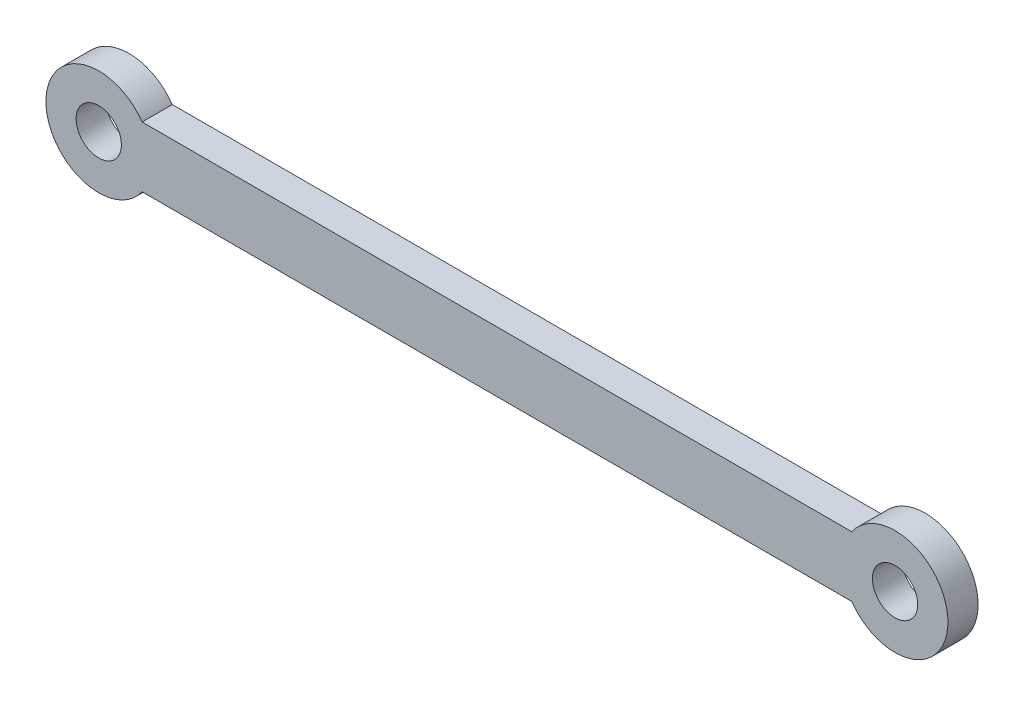
ISO-10303-21;
HEADER;
FILE_DESCRIPTION(('STEP AP214'),'2;1');
FILE_NAME('part.step','',(''),(''),'','','');
FILE_SCHEMA(('AUTOMOTIVE_DESIGN { 1 0 10303 214 1 1 1 1 }'));
ENDSEC;
DATA;
#1=APPLICATION_CONTEXT('core data for automotive mechanical design processes');
#2=APPLICATION_PROTOCOL_DEFINITION('international standard','automotive_design',2000,#1);
#3=PRODUCT_CONTEXT('',#1,'mechanical');
#4=PRODUCT('Part','Part','',(#3));
#5=PRODUCT_RELATED_PRODUCT_CATEGORY('part','',(#4));
#6=PRODUCT_DEFINITION_FORMATION('','',#4);
#7=PRODUCT_DEFINITION_CONTEXT('part definition',#1,'design');
#8=PRODUCT_DEFINITION('design','',#6,#7);
#9=PRODUCT_DEFINITION_SHAPE('','',#8);
#10=(LENGTH_UNIT() NAMED_UNIT(*) SI_UNIT(.MILLI.,.METRE.));
#11=(NAMED_UNIT(*) PLANE_ANGLE_UNIT() SI_UNIT($,.RADIAN.));
#12=(NAMED_UNIT(*) SI_UNIT($,.STERADIAN.) SOLID_ANGLE_UNIT());
#13=UNCERTAINTY_MEASURE_WITH_UNIT(LENGTH_MEASURE(1.E-05),#10,'distance_accuracy_value','');
#14=(GEOMETRIC_REPRESENTATION_CONTEXT(3) GLOBAL_UNCERTAINTY_ASSIGNED_CONTEXT((#13)) GLOBAL_UNIT_ASSIGNED_CONTEXT((#10,
#11,#12)) REPRESENTATION_CONTEXT('',''));
#15=CARTESIAN_POINT('',(0.,0.,0.));
#16=DIRECTION('',(0.,0.,1.));
#17=DIRECTION('',(1.,0.,0.));
#18=AXIS2_PLACEMENT_3D('',#15,#16,#17);
#19=CARTESIAN_POINT('',(-26.372281323269,0.,2.));
#20=DIRECTION('',(0.,0.,-1.));
#21=DIRECTION('',(-1.,0.,0.));
#22=AXIS2_PLACEMENT_3D('',#19,#20,#21);
#23=CYLINDRICAL_SURFACE('',#22,1.5);
#24=CARTESIAN_POINT('',(-26.372281323269,0.,2.));
#25=DIRECTION('',(0.,0.,1.));
#26=DIRECTION('',(1.,0.,0.));
#27=AXIS2_PLACEMENT_3D('',#24,#25,#26);
#28=CIRCLE('',#27,1.5);
#29=CARTESIAN_POINT('',(-24.872281323269,0.,2.));
#30=VERTEX_POINT('',#29);
#31=EDGE_CURVE('E138',#30,#30,#28,.T.);
#32=ORIENTED_EDGE('',*,*,#31,.T.);
#33=EDGE_LOOP('',(#32));
#34=FACE_BOUND('',#33,.T.);
#35=CARTESIAN_POINT('',(-26.372281323269,0.,0.));
#36=DIRECTION('',(0.,0.,1.));
#37=DIRECTION('',(1.,0.,0.));
#38=AXIS2_PLACEMENT_3D('',#35,#36,#37);
#39=CIRCLE('',#38,1.5);
#40=CARTESIAN_POINT('',(-24.872281323269,0.,0.));
#41=VERTEX_POINT('',#40);
#42=EDGE_CURVE('E131',#41,#41,#39,.T.);
#43=ORIENTED_EDGE('',*,*,#42,.F.);
#44=EDGE_LOOP('',(#43));
#45=FACE_BOUND('',#44,.T.);
#46=ADVANCED_FACE('F70',(#34,#45),#23,.F.);
#47=CARTESIAN_POINT('',(0.,0.,0.));
#48=DIRECTION('',(0.,0.,1.));
#49=DIRECTION('',(1.,0.,0.));
#50=AXIS2_PLACEMENT_3D('',#47,#48,#49);
#51=PLANE('',#50);
#52=CARTESIAN_POINT('',(-26.372281323269,0.,0.));
#53=DIRECTION('',(0.,0.,1.));
#54=DIRECTION('',(1.,0.,0.));
#55=AXIS2_PLACEMENT_3D('',#52,#53,#54);
#56=CIRCLE('',#55,3.5);
#57=CARTESIAN_POINT('',(-23.5,2.,0.));
#58=VERTEX_POINT('',#57);
#59=CARTESIAN_POINT('',(-23.5,-2.,0.));
#60=VERTEX_POINT('',#59);
#61=EDGE_CURVE('E145',#58,#60,#56,.T.);
#62=ORIENTED_EDGE('',*,*,#61,.F.);
#63=DIRECTION('',(1.,0.,0.));
#64=VECTOR('',#63,1.);
#65=CARTESIAN_POINT('',(0.,2.,0.));
#66=LINE('',#65,#64);
#67=CARTESIAN_POINT('',(23.5,2.,0.));
#68=VERTEX_POINT('',#67);
#69=EDGE_CURVE('E121',#58,#68,#66,.T.);
#70=ORIENTED_EDGE('',*,*,#69,.T.);
#71=CARTESIAN_POINT('',(26.372281323269,0.,0.));
#72=DIRECTION('',(0.,0.,1.));
#73=DIRECTION('',(1.,0.,0.));
#74=AXIS2_PLACEMENT_3D('',#71,#72,#73);
#75=CIRCLE('',#74,3.5);
#76=CARTESIAN_POINT('',(23.5,-2.,0.));
#77=VERTEX_POINT('',#76);
#78=EDGE_CURVE('E141',#68,#77,#75,.F.);
#79=ORIENTED_EDGE('',*,*,#78,.T.);
#80=DIRECTION('',(1.,0.,0.));
#81=VECTOR('',#80,1.);
#82=CARTESIAN_POINT('',(0.,-2.,0.));
#83=LINE('',#82,#81);
#84=EDGE_CURVE('E147',#60,#77,#83,.T.);
#85=ORIENTED_EDGE('',*,*,#84,.F.);
#86=EDGE_LOOP('',(#62,#70,#79,#85));
#87=FACE_BOUND('',#86,.T.);
#88=ORIENTED_EDGE('',*,*,#42,.T.);
#89=EDGE_LOOP('',(#88));
#90=FACE_BOUND('',#89,.T.);
#91=CARTESIAN_POINT('',(26.372281323269,0.,0.));
#92=DIRECTION('',(0.,0.,1.));
#93=DIRECTION('',(1.,0.,0.));
#94=AXIS2_PLACEMENT_3D('',#91,#92,#93);
#95=CIRCLE('',#94,1.5);
#96=CARTESIAN_POINT('',(27.872281323269,0.,0.));
#97=VERTEX_POINT('',#96);
#98=EDGE_CURVE('E149',#97,#97,#95,.F.);
#99=ORIENTED_EDGE('',*,*,#98,.F.);
#100=EDGE_LOOP('',(#99));
#101=FACE_BOUND('',#100,.T.);
#102=ADVANCED_FACE('F157',(#87,#90,#101),#51,.F.);
#103=CARTESIAN_POINT('',(-26.372281323269,0.,2.));
#104=DIRECTION('',(0.,0.,-1.));
#105=DIRECTION('',(-1.,0.,0.));
#106=AXIS2_PLACEMENT_3D('',#103,#104,#105);
#107=CYLINDRICAL_SURFACE('',#106,3.5);
#108=ORIENTED_EDGE('',*,*,#61,.T.);
#109=DIRECTION('',(0.,0.,-1.));
#110=VECTOR('',#109,1.);
#111=CARTESIAN_POINT('',(-23.5,-2.,2.));
#112=LINE('',#111,#110);
#113=CARTESIAN_POINT('',(-23.5,-2.,2.));
#114=VERTEX_POINT('',#113);
#115=EDGE_CURVE('E102',#114,#60,#112,.T.);
#116=ORIENTED_EDGE('',*,*,#115,.F.);
#117=CARTESIAN_POINT('',(-26.372281323269,0.,2.));
#118=DIRECTION('',(0.,0.,1.));
#119=DIRECTION('',(1.,0.,0.));
#120=AXIS2_PLACEMENT_3D('',#117,#118,#119);
#121=CIRCLE('',#120,3.5);
#122=CARTESIAN_POINT('',(-23.5,2.,2.));
#123=VERTEX_POINT('',#122);
#124=EDGE_CURVE('E124',#123,#114,#121,.T.);
#125=ORIENTED_EDGE('',*,*,#124,.F.);
#126=DIRECTION('',(0.,0.,-1.));
#127=VECTOR('',#126,1.);
#128=CARTESIAN_POINT('',(-23.5,2.,2.));
#129=LINE('',#128,#127);
#130=EDGE_CURVE('E79',#123,#58,#129,.T.);
#131=ORIENTED_EDGE('',*,*,#130,.T.);
#132=EDGE_LOOP('',(#108,#116,#125,#131));
#133=FACE_BOUND('',#132,.T.);
#134=ADVANCED_FACE('F125',(#133),#107,.T.);
#135=CARTESIAN_POINT('',(0.,0.,2.));
#136=DIRECTION('',(0.,0.,1.));
#137=DIRECTION('',(1.,0.,0.));
#138=AXIS2_PLACEMENT_3D('',#135,#136,#137);
#139=PLANE('',#138);
#140=ORIENTED_EDGE('',*,*,#124,.T.);
#141=DIRECTION('',(1.,0.,0.));
#142=VECTOR('',#141,1.);
#143=CARTESIAN_POINT('',(0.,-2.,2.));
#144=LINE('',#143,#142);
#145=CARTESIAN_POINT('',(23.5,-2.,2.));
#146=VERTEX_POINT('',#145);
#147=EDGE_CURVE('E87',#114,#146,#144,.T.);
#148=ORIENTED_EDGE('',*,*,#147,.T.);
#149=CARTESIAN_POINT('',(26.372281323269,0.,2.));
#150=DIRECTION('',(0.,0.,1.));
#151=DIRECTION('',(1.,0.,0.));
#152=AXIS2_PLACEMENT_3D('',#149,#150,#151);
#153=CIRCLE('',#152,3.5);
#154=CARTESIAN_POINT('',(23.5,2.,2.));
#155=VERTEX_POINT('',#154);
#156=EDGE_CURVE('E129',#155,#146,#153,.F.);
#157=ORIENTED_EDGE('',*,*,#156,.F.);
#158=DIRECTION('',(1.,0.,0.));
#159=VECTOR('',#158,1.);
#160=CARTESIAN_POINT('',(0.,2.,2.));
#161=LINE('',#160,#159);
#162=EDGE_CURVE('E119',#123,#155,#161,.T.);
#163=ORIENTED_EDGE('',*,*,#162,.F.);
#164=EDGE_LOOP('',(#140,#148,#157,#163));
#165=FACE_BOUND('',#164,.T.);
#166=ORIENTED_EDGE('',*,*,#31,.F.);
#167=EDGE_LOOP('',(#166));
#168=FACE_BOUND('',#167,.T.);
#169=CARTESIAN_POINT('',(26.372281323269,0.,2.));
#170=DIRECTION('',(0.,0.,1.));
#171=DIRECTION('',(1.,0.,0.));
#172=AXIS2_PLACEMENT_3D('',#169,#170,#171);
#173=CIRCLE('',#172,1.5);
#174=CARTESIAN_POINT('',(27.872281323269,0.,2.));
#175=VERTEX_POINT('',#174);
#176=EDGE_CURVE('E135',#175,#175,#173,.F.);
#177=ORIENTED_EDGE('',*,*,#176,.T.);
#178=EDGE_LOOP('',(#177));
#179=FACE_BOUND('',#178,.T.);
#180=ADVANCED_FACE('F127',(#165,#168,#179),#139,.T.);
#181=CARTESIAN_POINT('',(0.,-2.,2.));
#182=DIRECTION('',(0.,1.,0.));
#183=DIRECTION('',(0.,0.,1.));
#184=AXIS2_PLACEMENT_3D('',#181,#182,#183);
#185=PLANE('',#184);
#186=ORIENTED_EDGE('',*,*,#84,.T.);
#187=DIRECTION('',(0.,0.,-1.));
#188=VECTOR('',#187,1.);
#189=CARTESIAN_POINT('',(23.5,-2.,2.));
#190=LINE('',#189,#188);
#191=EDGE_CURVE('E109',#146,#77,#190,.T.);
#192=ORIENTED_EDGE('',*,*,#191,.F.);
#193=ORIENTED_EDGE('',*,*,#147,.F.);
#194=ORIENTED_EDGE('',*,*,#115,.T.);
#195=EDGE_LOOP('',(#186,#192,#193,#194));
#196=FACE_BOUND('',#195,.T.);
#197=ADVANCED_FACE('F163',(#196),#185,.F.);
#198=CARTESIAN_POINT('',(26.372281323269,0.,2.));
#199=DIRECTION('',(0.,0.,-1.));
#200=DIRECTION('',(-1.,0.,0.));
#201=AXIS2_PLACEMENT_3D('',#198,#199,#200);
#202=CYLINDRICAL_SURFACE('',#201,3.5);
#203=ORIENTED_EDGE('',*,*,#78,.F.);
#204=DIRECTION('',(0.,0.,-1.));
#205=VECTOR('',#204,1.);
#206=CARTESIAN_POINT('',(23.5,2.,2.));
#207=LINE('',#206,#205);
#208=EDGE_CURVE('E12',#155,#68,#207,.T.);
#209=ORIENTED_EDGE('',*,*,#208,.F.);
#210=ORIENTED_EDGE('',*,*,#156,.T.);
#211=ORIENTED_EDGE('',*,*,#191,.T.);
#212=EDGE_LOOP('',(#203,#209,#210,#211));
#213=FACE_BOUND('',#212,.T.);
#214=ADVANCED_FACE('F72',(#213),#202,.T.);
#215=CARTESIAN_POINT('',(0.,2.,2.));
#216=DIRECTION('',(0.,1.,0.));
#217=DIRECTION('',(0.,0.,1.));
#218=AXIS2_PLACEMENT_3D('',#215,#216,#217);
#219=PLANE('',#218);
#220=ORIENTED_EDGE('',*,*,#69,.F.);
#221=ORIENTED_EDGE('',*,*,#130,.F.);
#222=ORIENTED_EDGE('',*,*,#162,.T.);
#223=ORIENTED_EDGE('',*,*,#208,.T.);
#224=EDGE_LOOP('',(#220,#221,#222,#223));
#225=FACE_BOUND('',#224,.T.);
#226=ADVANCED_FACE('F117',(#225),#219,.T.);
#227=CARTESIAN_POINT('',(26.372281323269,0.,2.));
#228=DIRECTION('',(0.,0.,-1.));
#229=DIRECTION('',(-1.,0.,0.));
#230=AXIS2_PLACEMENT_3D('',#227,#228,#229);
#231=CYLINDRICAL_SURFACE('',#230,1.5);
#232=ORIENTED_EDGE('',*,*,#176,.F.);
#233=EDGE_LOOP('',(#232));
#234=FACE_BOUND('',#233,.T.);
#235=ORIENTED_EDGE('',*,*,#98,.T.);
#236=EDGE_LOOP('',(#235));
#237=FACE_BOUND('',#236,.T.);
#238=ADVANCED_FACE('F178',(#234,#237),#231,.F.);
#239=CLOSED_SHELL('',(#46,#102,#134,#180,#197,#214,#226,#238));
#240=MANIFOLD_SOLID_BREP('B2',#239);
#241=ADVANCED_BREP_SHAPE_REPRESENTATION('',(#18,#240),#14);
#242=SHAPE_DEFINITION_REPRESENTATION(#9,#241);
ENDSEC;
END-ISO-10303-21;
